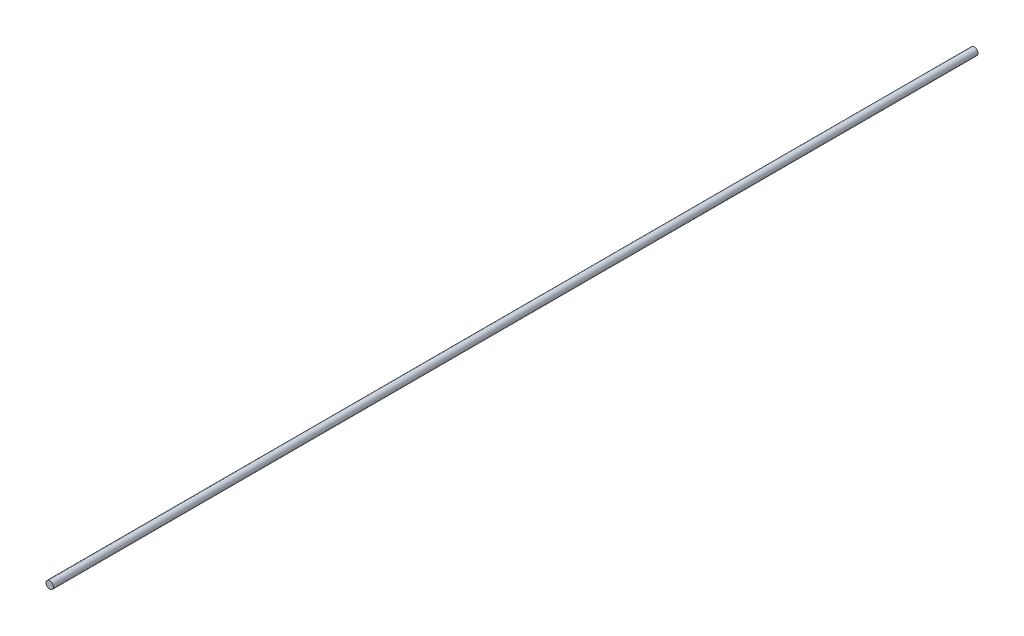
ISO-10303-21;
HEADER;
FILE_DESCRIPTION(('STEP AP214'),'2;1');
FILE_NAME('part.step','',(''),(''),'','','');
FILE_SCHEMA(('AUTOMOTIVE_DESIGN { 1 0 10303 214 1 1 1 1 }'));
ENDSEC;
DATA;
#1=APPLICATION_CONTEXT('core data for automotive mechanical design processes');
#2=APPLICATION_PROTOCOL_DEFINITION('international standard','automotive_design',2000,#1);
#3=PRODUCT_CONTEXT('',#1,'mechanical');
#4=PRODUCT('Part','Part','',(#3));
#5=PRODUCT_RELATED_PRODUCT_CATEGORY('part','',(#4));
#6=PRODUCT_DEFINITION_FORMATION('','',#4);
#7=PRODUCT_DEFINITION_CONTEXT('part definition',#1,'design');
#8=PRODUCT_DEFINITION('design','',#6,#7);
#9=PRODUCT_DEFINITION_SHAPE('','',#8);
#10=(LENGTH_UNIT() NAMED_UNIT(*) SI_UNIT(.MILLI.,.METRE.));
#11=(NAMED_UNIT(*) PLANE_ANGLE_UNIT() SI_UNIT($,.RADIAN.));
#12=(NAMED_UNIT(*) SI_UNIT($,.STERADIAN.) SOLID_ANGLE_UNIT());
#13=UNCERTAINTY_MEASURE_WITH_UNIT(LENGTH_MEASURE(1.E-05),#10,'distance_accuracy_value','');
#14=(GEOMETRIC_REPRESENTATION_CONTEXT(3) GLOBAL_UNCERTAINTY_ASSIGNED_CONTEXT((#13)) GLOBAL_UNIT_ASSIGNED_CONTEXT((#10,
#11,#12)) REPRESENTATION_CONTEXT('',''));
#15=CARTESIAN_POINT('',(0.,0.,0.));
#16=DIRECTION('',(0.,0.,1.));
#17=DIRECTION('',(1.,0.,0.));
#18=AXIS2_PLACEMENT_3D('',#15,#16,#17);
#19=CARTESIAN_POINT('',(0.,0.,500.));
#20=DIRECTION('',(0.,0.,-1.));
#21=DIRECTION('',(-1.,0.,0.));
#22=AXIS2_PLACEMENT_3D('',#19,#20,#21);
#23=CYLINDRICAL_SURFACE('',#22,4.);
#24=CARTESIAN_POINT('',(0.,0.,500.));
#25=DIRECTION('',(0.,0.,1.));
#26=DIRECTION('',(1.,0.,0.));
#27=AXIS2_PLACEMENT_3D('',#24,#25,#26);
#28=CIRCLE('',#27,4.);
#29=CARTESIAN_POINT('',(4.,0.,500.));
#30=VERTEX_POINT('',#29);
#31=EDGE_CURVE('E10',#30,#30,#28,.T.);
#32=ORIENTED_EDGE('',*,*,#31,.F.);
#33=EDGE_LOOP('',(#32));
#34=FACE_BOUND('',#33,.T.);
#35=CARTESIAN_POINT('',(0.,0.,-500.));
#36=DIRECTION('',(0.,0.,1.));
#37=DIRECTION('',(1.,0.,0.));
#38=AXIS2_PLACEMENT_3D('',#35,#36,#37);
#39=CIRCLE('',#38,4.);
#40=CARTESIAN_POINT('',(4.,0.,-500.));
#41=VERTEX_POINT('',#40);
#42=EDGE_CURVE('E39',#41,#41,#39,.T.);
#43=ORIENTED_EDGE('',*,*,#42,.T.);
#44=EDGE_LOOP('',(#43));
#45=FACE_BOUND('',#44,.T.);
#46=ADVANCED_FACE('F36',(#34,#45),#23,.T.);
#47=CARTESIAN_POINT('',(0.,0.,500.));
#48=DIRECTION('',(0.,0.,1.));
#49=DIRECTION('',(1.,0.,0.));
#50=AXIS2_PLACEMENT_3D('',#47,#48,#49);
#51=PLANE('',#50);
#52=ORIENTED_EDGE('',*,*,#31,.T.);
#53=EDGE_LOOP('',(#52));
#54=FACE_BOUND('',#53,.T.);
#55=ADVANCED_FACE('F51',(#54),#51,.T.);
#56=CARTESIAN_POINT('',(0.,0.,-500.));
#57=DIRECTION('',(0.,0.,1.));
#58=DIRECTION('',(1.,0.,0.));
#59=AXIS2_PLACEMENT_3D('',#56,#57,#58);
#60=PLANE('',#59);
#61=ORIENTED_EDGE('',*,*,#42,.F.);
#62=EDGE_LOOP('',(#61));
#63=FACE_BOUND('',#62,.T.);
#64=ADVANCED_FACE('F49',(#63),#60,.F.);
#65=CLOSED_SHELL('',(#46,#55,#64));
#66=MANIFOLD_SOLID_BREP('B2',#65);
#67=ADVANCED_BREP_SHAPE_REPRESENTATION('',(#18,#66),#14);
#68=SHAPE_DEFINITION_REPRESENTATION(#9,#67);
ENDSEC;
END-ISO-10303-21;
